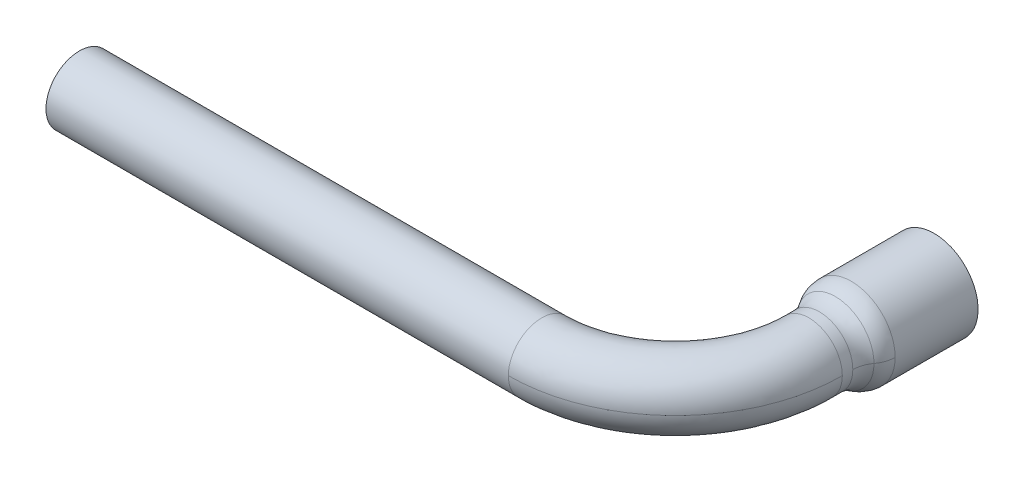
ISO-10303-21;
HEADER;
FILE_DESCRIPTION(('STEP AP214'),'2;1');
FILE_NAME('part.step','',(''),(''),'','','');
FILE_SCHEMA(('AUTOMOTIVE_DESIGN { 1 0 10303 214 1 1 1 1 }'));
ENDSEC;
DATA;
#1=APPLICATION_CONTEXT('core data for automotive mechanical design processes');
#2=APPLICATION_PROTOCOL_DEFINITION('international standard','automotive_design',2000,#1);
#3=PRODUCT_CONTEXT('',#1,'mechanical');
#4=PRODUCT('Part','Part','',(#3));
#5=PRODUCT_RELATED_PRODUCT_CATEGORY('part','',(#4));
#6=PRODUCT_DEFINITION_FORMATION('','',#4);
#7=PRODUCT_DEFINITION_CONTEXT('part definition',#1,'design');
#8=PRODUCT_DEFINITION('design','',#6,#7);
#9=PRODUCT_DEFINITION_SHAPE('','',#8);
#10=(LENGTH_UNIT() NAMED_UNIT(*) SI_UNIT(.MILLI.,.METRE.));
#11=(NAMED_UNIT(*) PLANE_ANGLE_UNIT() SI_UNIT($,.RADIAN.));
#12=(NAMED_UNIT(*) SI_UNIT($,.STERADIAN.) SOLID_ANGLE_UNIT());
#13=UNCERTAINTY_MEASURE_WITH_UNIT(LENGTH_MEASURE(1.E-05),#10,'distance_accuracy_value','');
#14=(GEOMETRIC_REPRESENTATION_CONTEXT(3) GLOBAL_UNCERTAINTY_ASSIGNED_CONTEXT((#13)) GLOBAL_UNIT_ASSIGNED_CONTEXT((#10,
#11,#12)) REPRESENTATION_CONTEXT('',''));
#15=CARTESIAN_POINT('',(0.,0.,0.));
#16=DIRECTION('',(0.,0.,1.));
#17=DIRECTION('',(1.,0.,0.));
#18=AXIS2_PLACEMENT_3D('',#15,#16,#17);
#19=CARTESIAN_POINT('',(-3.2131,-3.2131,0.));
#20=DIRECTION('',(0.,0.,1.));
#21=DIRECTION('',(1.,0.,0.));
#22=AXIS2_PLACEMENT_3D('',#19,#20,#21);
#23=PLANE('',#22);
#24=CARTESIAN_POINT('',(0.,0.,0.));
#25=DIRECTION('',(0.,0.,1.));
#26=DIRECTION('',(1.,0.,0.));
#27=AXIS2_PLACEMENT_3D('',#24,#25,#26);
#28=CIRCLE('',#27,3.175);
#29=CARTESIAN_POINT('',(3.175,0.,0.));
#30=VERTEX_POINT('',#29);
#31=EDGE_CURVE('E21',#30,#30,#28,.T.);
#32=ORIENTED_EDGE('',*,*,#31,.F.);
#33=EDGE_LOOP('',(#32));
#34=FACE_BOUND('',#33,.T.);
#35=ADVANCED_FACE('F17',(#34),#23,.F.);
#36=CARTESIAN_POINT('',(0.,0.,-7.62));
#37=DIRECTION('',(0.,0.,1.));
#38=DIRECTION('',(1.,0.,0.));
#39=AXIS2_PLACEMENT_3D('',#36,#37,#38);
#40=CYLINDRICAL_SURFACE('',#39,3.175);
#41=CARTESIAN_POINT('',(0.,0.,-7.62));
#42=DIRECTION('',(0.,0.,1.));
#43=DIRECTION('',(1.,0.,0.));
#44=AXIS2_PLACEMENT_3D('',#41,#42,#43);
#45=CIRCLE('',#44,3.175);
#46=CARTESIAN_POINT('',(3.175,0.,-7.62));
#47=VERTEX_POINT('',#46);
#48=EDGE_CURVE('E121',#47,#47,#45,.T.);
#49=ORIENTED_EDGE('',*,*,#48,.F.);
#50=EDGE_LOOP('',(#49));
#51=FACE_BOUND('',#50,.T.);
#52=ORIENTED_EDGE('',*,*,#31,.T.);
#53=EDGE_LOOP('',(#52));
#54=FACE_BOUND('',#53,.T.);
#55=ADVANCED_FACE('F128',(#51,#54),#40,.F.);
#56=CARTESIAN_POINT('',(4.2251,-4.2251,-7.62));
#57=DIRECTION('',(0.,0.,-1.));
#58=DIRECTION('',(-1.,0.,0.));
#59=AXIS2_PLACEMENT_3D('',#56,#57,#58);
#60=PLANE('',#59);
#61=ORIENTED_EDGE('',*,*,#48,.T.);
#62=EDGE_LOOP('',(#61));
#63=FACE_BOUND('',#62,.T.);
#64=CARTESIAN_POINT('',(0.,0.,-7.62));
#65=DIRECTION('',(0.,0.,-1.));
#66=DIRECTION('',(-1.,0.,0.));
#67=AXIS2_PLACEMENT_3D('',#64,#65,#66);
#68=CIRCLE('',#67,4.175);
#69=CARTESIAN_POINT('',(-4.175,0.,-7.62));
#70=VERTEX_POINT('',#69);
#71=EDGE_CURVE('E81',#70,#70,#68,.T.);
#72=ORIENTED_EDGE('',*,*,#71,.T.);
#73=EDGE_LOOP('',(#72));
#74=FACE_BOUND('',#73,.T.);
#75=ADVANCED_FACE('F136',(#63,#74),#60,.T.);
#76=CARTESIAN_POINT('',(0.,0.,0.263351798));
#77=DIRECTION('',(0.,0.,-1.));
#78=DIRECTION('',(-1.,0.,0.));
#79=AXIS2_PLACEMENT_3D('',#76,#77,#78);
#80=CYLINDRICAL_SURFACE('',#79,4.175);
#81=CARTESIAN_POINT('',(0.,0.,0.263351798));
#82=DIRECTION('',(0.,0.,1.));
#83=DIRECTION('',(1.,0.,0.));
#84=AXIS2_PLACEMENT_3D('',#81,#82,#83);
#85=CIRCLE('',#84,4.175);
#86=CARTESIAN_POINT('',(-4.175,-1.8744419934498E-10,0.263351798));
#87=VERTEX_POINT('',#86);
#88=CARTESIAN_POINT('',(4.175,-6.42230110538631E-10,0.263351798));
#89=VERTEX_POINT('',#88);
#90=EDGE_CURVE('E83',#87,#89,#85,.T.);
#91=ORIENTED_EDGE('',*,*,#90,.F.);
#92=CARTESIAN_POINT('',(0.,0.,0.263351798));
#93=DIRECTION('',(0.,0.,1.));
#94=DIRECTION('',(1.,0.,0.));
#95=AXIS2_PLACEMENT_3D('',#92,#93,#94);
#96=CIRCLE('',#95,4.175);
#97=EDGE_CURVE('E72',#89,#87,#96,.T.);
#98=ORIENTED_EDGE('',*,*,#97,.F.);
#99=EDGE_LOOP('',(#91,#98));
#100=FACE_BOUND('',#99,.T.);
#101=ORIENTED_EDGE('',*,*,#71,.F.);
#102=EDGE_LOOP('',(#101));
#103=FACE_BOUND('',#102,.T.);
#104=ADVANCED_FACE('F84',(#100,#103),#80,.T.);
#105=CARTESIAN_POINT('',(-4.175,0.,0.263351798));
#106=CARTESIAN_POINT('',(-4.175,8.35,0.263351798));
#107=CARTESIAN_POINT('',(4.175,8.35,0.263351798));
#108=CARTESIAN_POINT('',(4.175,0.,0.263351798));
#109=CARTESIAN_POINT('',(-4.175,0.,0.813101204));
#110=CARTESIAN_POINT('',(-4.175,8.35,0.813101204));
#111=CARTESIAN_POINT('',(4.175,8.35,0.813101204));
#112=CARTESIAN_POINT('',(4.175,0.,0.813101204));
#113=CARTESIAN_POINT('',(-4.002528272,0.,1.335095373));
#114=CARTESIAN_POINT('',(-4.002528272,8.005056544,1.335095373));
#115=CARTESIAN_POINT('',(4.002528272,8.005056544,1.335095373));
#116=CARTESIAN_POINT('',(4.002528272,0.,1.335095373));
#117=CARTESIAN_POINT('',(-3.675,0.,1.776626393));
#118=CARTESIAN_POINT('',(-3.675,7.35,1.776626393));
#119=CARTESIAN_POINT('',(3.675,7.35,1.776626393));
#120=CARTESIAN_POINT('',(3.675,0.,1.776626393));
#121=(BOUNDED_SURFACE() B_SPLINE_SURFACE(3,3,((#105,#106,#107,#108),(#109,#110,#111,#112),(#113,
#114,#115,#116),(#117,#118,#119,#120)),.UNSPECIFIED.,.F.,.F.,
.F.) B_SPLINE_SURFACE_WITH_KNOTS((4,4),(4,4),(0.,1.),(0.,1.),
.UNSPECIFIED.) GEOMETRIC_REPRESENTATION_ITEM() RATIONAL_B_SPLINE_SURFACE(((1.,0.333333333333333,
0.333333333333333,1.),(0.966341952951531,0.322113984317177,0.322113984317177,0.966341952951531),
(0.966341952951531,0.322113984317177,0.322113984317177,0.966341952951531),(1.,0.333333333333333,
0.333333333333333,1.))) REPRESENTATION_ITEM('') SURFACE());
#122=CARTESIAN_POINT('',(-4.175,0.,0.263351798));
#123=CARTESIAN_POINT('',(-4.175,0.,0.813101204));
#124=CARTESIAN_POINT('',(-4.002528272,0.,1.335095373));
#125=CARTESIAN_POINT('',(-3.675,0.,1.776626393));
#126=(BOUNDED_CURVE() B_SPLINE_CURVE(3,(#122,#123,#124,#125),.UNSPECIFIED.,.F.,
.F.) B_SPLINE_CURVE_WITH_KNOTS((4,4),(0.,1.),
.UNSPECIFIED.) CURVE() GEOMETRIC_REPRESENTATION_ITEM() RATIONAL_B_SPLINE_CURVE((1.,
0.966341952951531,0.966341952951531,1.)) REPRESENTATION_ITEM(''));
#127=CARTESIAN_POINT('',(-3.67500000002567,0.,1.7766263924728));
#128=VERTEX_POINT('',#127);
#129=EDGE_CURVE('E77',#128,#87,#126,.F.);
#130=CARTESIAN_POINT('',(0.,0.,1.77662639229558));
#131=DIRECTION('',(0.,0.,-1.));
#132=DIRECTION('',(0.,1.,0.));
#133=AXIS2_PLACEMENT_3D('',#130,#131,#132);
#134=CIRCLE('',#133,3.67500000003533);
#135=CARTESIAN_POINT('',(3.67500000002567,0.,1.7766263924728));
#136=VERTEX_POINT('',#135);
#137=EDGE_CURVE('E87',#128,#136,#134,.T.);
#138=CARTESIAN_POINT('',(4.175,0.,0.263351798));
#139=CARTESIAN_POINT('',(4.175,0.,0.813101204));
#140=CARTESIAN_POINT('',(4.002528272,0.,1.335095373));
#141=CARTESIAN_POINT('',(3.675,0.,1.776626393));
#142=(BOUNDED_CURVE() B_SPLINE_CURVE(3,(#138,#139,#140,#141),.UNSPECIFIED.,.F.,
.F.) B_SPLINE_CURVE_WITH_KNOTS((4,4),(0.,1.),
.UNSPECIFIED.) CURVE() GEOMETRIC_REPRESENTATION_ITEM() RATIONAL_B_SPLINE_CURVE((1.,
0.966341952951531,0.966341952951531,1.)) REPRESENTATION_ITEM(''));
#143=EDGE_CURVE('E79',#89,#136,#142,.T.);
#144=ORIENTED_EDGE('',*,*,#97,.T.);
#145=ORIENTED_EDGE('',*,*,#129,.F.);
#146=ORIENTED_EDGE('',*,*,#137,.T.);
#147=ORIENTED_EDGE('',*,*,#143,.F.);
#148=EDGE_LOOP('',(#144,#145,#146,#147));
#149=FACE_BOUND('',#148,.T.);
#150=ADVANCED_FACE('F75',(#149),#121,.T.);
#151=CARTESIAN_POINT('',(4.175,0.,0.263351798));
#152=CARTESIAN_POINT('',(4.175,-8.35,0.263351798));
#153=CARTESIAN_POINT('',(-4.175,-8.35,0.263351798));
#154=CARTESIAN_POINT('',(-4.175,0.,0.263351798));
#155=CARTESIAN_POINT('',(4.175,0.,0.813101204));
#156=CARTESIAN_POINT('',(4.175,-8.35,0.813101204));
#157=CARTESIAN_POINT('',(-4.175,-8.35,0.813101204));
#158=CARTESIAN_POINT('',(-4.175,0.,0.813101204));
#159=CARTESIAN_POINT('',(4.002528272,0.,1.335095373));
#160=CARTESIAN_POINT('',(4.002528272,-8.005056544,1.335095373));
#161=CARTESIAN_POINT('',(-4.002528272,-8.005056544,1.335095373));
#162=CARTESIAN_POINT('',(-4.002528272,0.,1.335095373));
#163=CARTESIAN_POINT('',(3.675,0.,1.776626393));
#164=CARTESIAN_POINT('',(3.675,-7.35,1.776626393));
#165=CARTESIAN_POINT('',(-3.675,-7.35,1.776626393));
#166=CARTESIAN_POINT('',(-3.675,0.,1.776626393));
#167=(BOUNDED_SURFACE() B_SPLINE_SURFACE(3,3,((#151,#152,#153,#154),(#155,#156,#157,#158),(#159,
#160,#161,#162),(#163,#164,#165,#166)),.UNSPECIFIED.,.F.,.F.,
.F.) B_SPLINE_SURFACE_WITH_KNOTS((4,4),(4,4),(0.,1.),(0.,1.),
.UNSPECIFIED.) GEOMETRIC_REPRESENTATION_ITEM() RATIONAL_B_SPLINE_SURFACE(((1.,0.333333333333333,
0.333333333333333,1.),(0.966341952951531,0.322113984317177,0.322113984317177,0.966341952951531),
(0.966341952951531,0.322113984317177,0.322113984317177,0.966341952951531),(1.,0.333333333333333,
0.333333333333333,1.))) REPRESENTATION_ITEM('') SURFACE());
#168=CARTESIAN_POINT('',(0.,0.,1.77662639229558));
#169=DIRECTION('',(0.,0.,-1.));
#170=DIRECTION('',(0.,1.,0.));
#171=AXIS2_PLACEMENT_3D('',#168,#169,#170);
#172=CIRCLE('',#171,3.67500000003533);
#173=EDGE_CURVE('E92',#136,#128,#172,.T.);
#174=ORIENTED_EDGE('',*,*,#129,.T.);
#175=ORIENTED_EDGE('',*,*,#90,.T.);
#176=ORIENTED_EDGE('',*,*,#143,.T.);
#177=ORIENTED_EDGE('',*,*,#173,.T.);
#178=EDGE_LOOP('',(#174,#175,#176,#177));
#179=FACE_BOUND('',#178,.T.);
#180=ADVANCED_FACE('F90',(#179),#167,.T.);
#181=CARTESIAN_POINT('',(-3.18768942,0.,3.543477866));
#182=CARTESIAN_POINT('',(-3.18768942,6.37537884,3.543477866));
#183=CARTESIAN_POINT('',(3.18768942,6.37537884,3.543477866));
#184=CARTESIAN_POINT('',(3.18768942,0.,3.543477866));
#185=CARTESIAN_POINT('',(-3.114680729,0.,2.815826202));
#186=CARTESIAN_POINT('',(-3.114680729,6.229361458,2.815826202));
#187=CARTESIAN_POINT('',(3.114680729,6.229361458,2.815826202));
#188=CARTESIAN_POINT('',(3.114680729,0.,2.815826202));
#189=CARTESIAN_POINT('',(-3.344111558,0.,2.121442512));
#190=CARTESIAN_POINT('',(-3.344111558,6.688223116,2.121442512));
#191=CARTESIAN_POINT('',(3.344111558,6.688223116,2.121442512));
#192=CARTESIAN_POINT('',(3.344111558,0.,2.121442512));
#193=CARTESIAN_POINT('',(-3.836266876,0.,1.580526292));
#194=CARTESIAN_POINT('',(-3.836266876,7.672533752,1.580526292));
#195=CARTESIAN_POINT('',(3.836266876,7.672533752,1.580526292));
#196=CARTESIAN_POINT('',(3.836266876,0.,1.580526292));
#197=(BOUNDED_SURFACE() B_SPLINE_SURFACE(3,3,((#181,#182,#183,#184),(#185,#186,#187,#188),(#189,
#190,#191,#192),(#193,#194,#195,#196)),.UNSPECIFIED.,.F.,.F.,
.F.) B_SPLINE_SURFACE_WITH_KNOTS((4,4),(4,4),(0.,1.),(0.,1.),
.UNSPECIFIED.) GEOMETRIC_REPRESENTATION_ITEM() RATIONAL_B_SPLINE_SURFACE(((1.,0.333333333333333,
0.333333333333333,1.),(0.94229919423639,0.31409973141213,0.31409973141213,0.94229919423639),
(0.94229919423639,0.31409973141213,0.31409973141213,0.94229919423639),(1.,0.333333333333333,
0.333333333333333,1.))) REPRESENTATION_ITEM('') SURFACE());
#198=CARTESIAN_POINT('',(-3.18768942,0.,3.543477866));
#199=CARTESIAN_POINT('',(-3.114680729,0.,2.815826202));
#200=CARTESIAN_POINT('',(-3.344111558,0.,2.121442512));
#201=CARTESIAN_POINT('',(-3.836266876,0.,1.580526292));
#202=(BOUNDED_CURVE() B_SPLINE_CURVE(3,(#198,#199,#200,#201),.UNSPECIFIED.,.F.,
.F.) B_SPLINE_CURVE_WITH_KNOTS((4,4),(0.,1.),
.UNSPECIFIED.) CURVE() GEOMETRIC_REPRESENTATION_ITEM() RATIONAL_B_SPLINE_CURVE((1.,
0.94229919423639,0.94229919423639,1.)) REPRESENTATION_ITEM(''));
#203=CARTESIAN_POINT('',(-3.17499999996243,-2.85094770261227E-10,3.28990098796332));
#204=VERTEX_POINT('',#203);
#205=EDGE_CURVE('E58',#128,#204,#202,.F.);
#206=CARTESIAN_POINT('',(0.,0.,3.289900988));
#207=DIRECTION('',(0.,0.,-1.));
#208=DIRECTION('',(-1.,0.,0.));
#209=AXIS2_PLACEMENT_3D('',#206,#207,#208);
#210=CIRCLE('',#209,3.175);
#211=CARTESIAN_POINT('',(3.17499999996243,-9.76805078304265E-10,3.28990098796332));
#212=VERTEX_POINT('',#211);
#213=EDGE_CURVE('E316',#204,#212,#210,.T.);
#214=CARTESIAN_POINT('',(3.18768942,0.,3.543477866));
#215=CARTESIAN_POINT('',(3.114680729,0.,2.815826202));
#216=CARTESIAN_POINT('',(3.344111558,0.,2.121442512));
#217=CARTESIAN_POINT('',(3.836266876,0.,1.580526292));
#218=(BOUNDED_CURVE() B_SPLINE_CURVE(3,(#214,#215,#216,#217),.UNSPECIFIED.,.F.,
.F.) B_SPLINE_CURVE_WITH_KNOTS((4,4),(0.,1.),
.UNSPECIFIED.) CURVE() GEOMETRIC_REPRESENTATION_ITEM() RATIONAL_B_SPLINE_CURVE((1.,
0.94229919423639,0.94229919423639,1.)) REPRESENTATION_ITEM(''));
#219=EDGE_CURVE('E300',#212,#136,#218,.T.);
#220=ORIENTED_EDGE('',*,*,#137,.F.);
#221=ORIENTED_EDGE('',*,*,#205,.T.);
#222=ORIENTED_EDGE('',*,*,#213,.T.);
#223=ORIENTED_EDGE('',*,*,#219,.T.);
#224=EDGE_LOOP('',(#220,#221,#222,#223));
#225=FACE_BOUND('',#224,.T.);
#226=ADVANCED_FACE('F175',(#225),#197,.F.);
#227=CARTESIAN_POINT('',(3.18768942,0.,3.543477866));
#228=CARTESIAN_POINT('',(3.18768942,-6.37537884,3.543477866));
#229=CARTESIAN_POINT('',(-3.18768942,-6.37537884,3.543477866));
#230=CARTESIAN_POINT('',(-3.18768942,0.,3.543477866));
#231=CARTESIAN_POINT('',(3.114680729,0.,2.815826202));
#232=CARTESIAN_POINT('',(3.114680729,-6.229361458,2.815826202));
#233=CARTESIAN_POINT('',(-3.114680729,-6.229361458,2.815826202));
#234=CARTESIAN_POINT('',(-3.114680729,0.,2.815826202));
#235=CARTESIAN_POINT('',(3.344111558,0.,2.121442512));
#236=CARTESIAN_POINT('',(3.344111558,-6.688223116,2.121442512));
#237=CARTESIAN_POINT('',(-3.344111558,-6.688223116,2.121442512));
#238=CARTESIAN_POINT('',(-3.344111558,0.,2.121442512));
#239=CARTESIAN_POINT('',(3.836266876,0.,1.580526292));
#240=CARTESIAN_POINT('',(3.836266876,-7.672533752,1.580526292));
#241=CARTESIAN_POINT('',(-3.836266876,-7.672533752,1.580526292));
#242=CARTESIAN_POINT('',(-3.836266876,0.,1.580526292));
#243=(BOUNDED_SURFACE() B_SPLINE_SURFACE(3,3,((#227,#228,#229,#230),(#231,#232,#233,#234),(#235,
#236,#237,#238),(#239,#240,#241,#242)),.UNSPECIFIED.,.F.,.F.,
.F.) B_SPLINE_SURFACE_WITH_KNOTS((4,4),(4,4),(0.,1.),(0.,1.),
.UNSPECIFIED.) GEOMETRIC_REPRESENTATION_ITEM() RATIONAL_B_SPLINE_SURFACE(((1.,0.333333333333333,
0.333333333333333,1.),(0.94229919423639,0.31409973141213,0.31409973141213,0.94229919423639),
(0.94229919423639,0.31409973141213,0.31409973141213,0.94229919423639),(1.,0.333333333333333,
0.333333333333333,1.))) REPRESENTATION_ITEM('') SURFACE());
#244=CARTESIAN_POINT('',(0.,0.,3.289900988));
#245=DIRECTION('',(0.,0.,-1.));
#246=DIRECTION('',(-1.,0.,0.));
#247=AXIS2_PLACEMENT_3D('',#244,#245,#246);
#248=CIRCLE('',#247,3.175);
#249=EDGE_CURVE('E119',#212,#204,#248,.T.);
#250=ORIENTED_EDGE('',*,*,#219,.F.);
#251=ORIENTED_EDGE('',*,*,#249,.T.);
#252=ORIENTED_EDGE('',*,*,#205,.F.);
#253=ORIENTED_EDGE('',*,*,#173,.F.);
#254=EDGE_LOOP('',(#250,#251,#252,#253));
#255=FACE_BOUND('',#254,.T.);
#256=ADVANCED_FACE('F170',(#255),#243,.F.);
#257=CARTESIAN_POINT('',(-56.650003277,-3.2131,13.77383992));
#258=DIRECTION('',(-1.,0.,0.));
#259=DIRECTION('',(0.,0.,1.));
#260=AXIS2_PLACEMENT_3D('',#257,#258,#259);
#261=PLANE('',#260);
#262=CARTESIAN_POINT('',(-56.650003277,0.,16.98693992));
#263=DIRECTION('',(-1.,0.,0.));
#264=DIRECTION('',(0.,0.,1.));
#265=AXIS2_PLACEMENT_3D('',#262,#263,#264);
#266=CIRCLE('',#265,3.175);
#267=CARTESIAN_POINT('',(-56.650003277,0.,20.16193992));
#268=VERTEX_POINT('',#267);
#269=EDGE_CURVE('E116',#268,#268,#266,.T.);
#270=ORIENTED_EDGE('',*,*,#269,.T.);
#271=EDGE_LOOP('',(#270));
#272=FACE_BOUND('',#271,.T.);
#273=ADVANCED_FACE('F19',(#272),#261,.T.);
#274=CARTESIAN_POINT('',(0.,0.,4.28693992));
#275=DIRECTION('',(0.,0.,-1.));
#276=DIRECTION('',(-1.,0.,0.));
#277=AXIS2_PLACEMENT_3D('',#274,#275,#276);
#278=CYLINDRICAL_SURFACE('',#277,3.175);
#279=CARTESIAN_POINT('',(0.,0.,4.28693992));
#280=DIRECTION('',(0.,0.,-1.));
#281=DIRECTION('',(-1.,0.,0.));
#282=AXIS2_PLACEMENT_3D('',#279,#280,#281);
#283=CIRCLE('',#282,3.175);
#284=CARTESIAN_POINT('',(-3.175,-1.75654311156656E-09,4.28693992));
#285=VERTEX_POINT('',#284);
#286=CARTESIAN_POINT('',(3.17499999988794,-2.40774522707821E-09,4.28693992));
#287=VERTEX_POINT('',#286);
#288=EDGE_CURVE('E50',#285,#287,#283,.F.);
#289=ORIENTED_EDGE('',*,*,#288,.F.);
#290=CARTESIAN_POINT('',(0.,0.,4.28693992));
#291=DIRECTION('',(0.,0.,-1.));
#292=DIRECTION('',(-1.,0.,0.));
#293=AXIS2_PLACEMENT_3D('',#290,#291,#292);
#294=CIRCLE('',#293,3.175);
#295=EDGE_CURVE('E46',#287,#285,#294,.F.);
#296=ORIENTED_EDGE('',*,*,#295,.F.);
#297=EDGE_LOOP('',(#289,#296));
#298=FACE_BOUND('',#297,.T.);
#299=ORIENTED_EDGE('',*,*,#213,.F.);
#300=ORIENTED_EDGE('',*,*,#249,.F.);
#301=EDGE_LOOP('',(#299,#300));
#302=FACE_BOUND('',#301,.T.);
#303=ADVANCED_FACE('F167',(#298,#302),#278,.T.);
#304=CARTESIAN_POINT('',(-12.7,0.,16.98693992));
#305=DIRECTION('',(-1.,0.,0.));
#306=DIRECTION('',(0.,0.,1.));
#307=AXIS2_PLACEMENT_3D('',#304,#305,#306);
#308=CYLINDRICAL_SURFACE('',#307,3.175);
#309=CARTESIAN_POINT('',(-12.7,0.,16.98693992));
#310=DIRECTION('',(-1.,0.,0.));
#311=DIRECTION('',(0.,0.,1.));
#312=AXIS2_PLACEMENT_3D('',#309,#310,#311);
#313=CIRCLE('',#312,3.175);
#314=CARTESIAN_POINT('',(-12.7,-1.75654254653366E-09,20.16193992));
#315=VERTEX_POINT('',#314);
#316=CARTESIAN_POINT('',(-12.7,-2.40774579211112E-09,13.8119399198998));
#317=VERTEX_POINT('',#316);
#318=EDGE_CURVE('E27',#315,#317,#313,.F.);
#319=ORIENTED_EDGE('',*,*,#318,.F.);
#320=CARTESIAN_POINT('',(-12.7,0.,16.98693992));
#321=DIRECTION('',(-1.,0.,0.));
#322=DIRECTION('',(0.,0.,1.));
#323=AXIS2_PLACEMENT_3D('',#320,#321,#322);
#324=CIRCLE('',#323,3.175);
#325=EDGE_CURVE('E35',#317,#315,#324,.F.);
#326=ORIENTED_EDGE('',*,*,#325,.F.);
#327=EDGE_LOOP('',(#319,#326));
#328=FACE_BOUND('',#327,.T.);
#329=ORIENTED_EDGE('',*,*,#269,.F.);
#330=EDGE_LOOP('',(#329));
#331=FACE_BOUND('',#330,.T.);
#332=ADVANCED_FACE('F147',(#328,#331),#308,.T.);
#333=CARTESIAN_POINT('',(3.159138225,-0.316971098,4.28693992));
#334=CARTESIAN_POINT('',(3.159138225,-0.316971098,13.577008004));
#335=CARTESIAN_POINT('',(-3.409931915,-0.316971098,20.146078144));
#336=CARTESIAN_POINT('',(-12.7,-0.316971098,20.146078144));
#337=CARTESIAN_POINT('',(3.359887884,1.683829374,4.28693992));
#338=CARTESIAN_POINT('',(3.359887884,1.683829374,13.694604432));
#339=CARTESIAN_POINT('',(-3.292335488,1.683829374,20.346827804));
#340=CARTESIAN_POINT('',(-12.7,1.683829374,20.346827804));
#341=CARTESIAN_POINT('',(2.010846328,3.175,4.28693992));
#342=CARTESIAN_POINT('',(2.010846328,3.175,12.904354185));
#343=CARTESIAN_POINT('',(-4.082585735,3.175,18.997786248));
#344=CARTESIAN_POINT('',(-12.7,3.175,18.997786248));
#345=CARTESIAN_POINT('',(0.,3.175,4.28693992));
#346=CARTESIAN_POINT('',(0.,3.175,11.726427677));
#347=CARTESIAN_POINT('',(-5.260512242,3.175,16.98693992));
#348=CARTESIAN_POINT('',(-12.7,3.175,16.98693992));
#349=CARTESIAN_POINT('',(-2.010846328,3.175,4.28693992));
#350=CARTESIAN_POINT('',(-2.010846328,3.175,10.54850117));
#351=CARTESIAN_POINT('',(-6.438438749,3.175,14.976093592));
#352=CARTESIAN_POINT('',(-12.7,3.175,14.976093592));
#353=CARTESIAN_POINT('',(-3.359887884,1.683829374,4.28693992));
#354=CARTESIAN_POINT('',(-3.359887884,1.683829374,9.758250923));
#355=CARTESIAN_POINT('',(-7.228688997,1.683829374,13.627052036));
#356=CARTESIAN_POINT('',(-12.7,1.683829374,13.627052036));
#357=CARTESIAN_POINT('',(-3.159138225,-0.316971098,4.28693992));
#358=CARTESIAN_POINT('',(-3.159138225,-0.316971098,9.875847351));
#359=CARTESIAN_POINT('',(-7.111092569,-0.316971098,13.827801695));
#360=CARTESIAN_POINT('',(-12.7,-0.316971098,13.827801695));
#361=(BOUNDED_SURFACE() B_SPLINE_SURFACE(3,3,((#333,#334,#335,#336),(#337,#338,#339,#340),(#341,
#342,#343,#344),(#345,#346,#347,#348),(#349,#350,#351,#352),(#353,#354,#355,#356),(#357,#358,
#359,#360)),.UNSPECIFIED.,.F.,.F.,.F.) B_SPLINE_SURFACE_WITH_KNOTS((4,3,4),(4,4),(0.,0.5,1.),
(0.,1.),.UNSPECIFIED.) GEOMETRIC_REPRESENTATION_ITEM() RATIONAL_B_SPLINE_SURFACE(((1.,
0.804737854124365,0.804737854124365,1.),(0.780588314885162,0.62816896547524,0.62816896547524,
0.780588314885162),(0.780588314885162,0.62816896547524,0.62816896547524,0.780588314885162),(1.,
0.804737854124365,0.804737854124365,1.),(0.780588314885162,0.62816896547524,0.62816896547524,
0.780588314885162),(0.780588314885162,0.62816896547524,0.62816896547524,0.780588314885162),(1.,
0.804737854124365,0.804737854124365,1.))) REPRESENTATION_ITEM('') SURFACE());
#362=CARTESIAN_POINT('',(-12.7,-3.51308583250411E-09,4.28693992));
#363=DIRECTION('',(0.,1.,0.));
#364=DIRECTION('',(0.,0.,1.));
#365=AXIS2_PLACEMENT_3D('',#362,#363,#364);
#366=CIRCLE('',#365,9.52499999979951);
#367=EDGE_CURVE('E11',#317,#285,#366,.T.);
#368=CARTESIAN_POINT('',(-12.7,-3.51308469108058E-09,4.28693992));
#369=DIRECTION('',(0.,-1.,0.));
#370=DIRECTION('',(0.,0.,-1.));
#371=AXIS2_PLACEMENT_3D('',#368,#369,#370);
#372=CIRCLE('',#371,15.8749999997759);
#373=EDGE_CURVE('E112',#287,#315,#372,.T.);
#374=ORIENTED_EDGE('',*,*,#367,.F.);
#375=ORIENTED_EDGE('',*,*,#325,.T.);
#376=ORIENTED_EDGE('',*,*,#373,.F.);
#377=ORIENTED_EDGE('',*,*,#295,.T.);
#378=EDGE_LOOP('',(#374,#375,#376,#377));
#379=FACE_BOUND('',#378,.T.);
#380=ADVANCED_FACE('F141',(#379),#361,.T.);
#381=CARTESIAN_POINT('',(-3.159138225,0.316971098,4.28693992));
#382=CARTESIAN_POINT('',(-3.159138225,0.316971098,9.875847351));
#383=CARTESIAN_POINT('',(-7.111092569,0.316971098,13.827801695));
#384=CARTESIAN_POINT('',(-12.7,0.316971098,13.827801695));
#385=CARTESIAN_POINT('',(-3.359887884,-1.683829374,4.28693992));
#386=CARTESIAN_POINT('',(-3.359887884,-1.683829374,9.758250923));
#387=CARTESIAN_POINT('',(-7.228688997,-1.683829374,13.627052036));
#388=CARTESIAN_POINT('',(-12.7,-1.683829374,13.627052036));
#389=CARTESIAN_POINT('',(-2.010846328,-3.175,4.28693992));
#390=CARTESIAN_POINT('',(-2.010846328,-3.175,10.54850117));
#391=CARTESIAN_POINT('',(-6.438438749,-3.175,14.976093592));
#392=CARTESIAN_POINT('',(-12.7,-3.175,14.976093592));
#393=CARTESIAN_POINT('',(0.,-3.175,4.28693992));
#394=CARTESIAN_POINT('',(0.,-3.175,11.726427677));
#395=CARTESIAN_POINT('',(-5.260512242,-3.175,16.98693992));
#396=CARTESIAN_POINT('',(-12.7,-3.175,16.98693992));
#397=CARTESIAN_POINT('',(2.010846328,-3.175,4.28693992));
#398=CARTESIAN_POINT('',(2.010846328,-3.175,12.904354185));
#399=CARTESIAN_POINT('',(-4.082585735,-3.175,18.997786248));
#400=CARTESIAN_POINT('',(-12.7,-3.175,18.997786248));
#401=CARTESIAN_POINT('',(3.359887884,-1.683829374,4.28693992));
#402=CARTESIAN_POINT('',(3.359887884,-1.683829374,13.694604432));
#403=CARTESIAN_POINT('',(-3.292335488,-1.683829374,20.346827804));
#404=CARTESIAN_POINT('',(-12.7,-1.683829374,20.346827804));
#405=CARTESIAN_POINT('',(3.159138225,0.316971098,4.28693992));
#406=CARTESIAN_POINT('',(3.159138225,0.316971098,13.577008004));
#407=CARTESIAN_POINT('',(-3.409931915,0.316971098,20.146078144));
#408=CARTESIAN_POINT('',(-12.7,0.316971098,20.146078144));
#409=(BOUNDED_SURFACE() B_SPLINE_SURFACE(3,3,((#381,#382,#383,#384),(#385,#386,#387,#388),(#389,
#390,#391,#392),(#393,#394,#395,#396),(#397,#398,#399,#400),(#401,#402,#403,#404),(#405,#406,
#407,#408)),.UNSPECIFIED.,.F.,.F.,.F.) B_SPLINE_SURFACE_WITH_KNOTS((4,3,4),(4,4),(0.,0.5,1.),
(0.,1.),.UNSPECIFIED.) GEOMETRIC_REPRESENTATION_ITEM() RATIONAL_B_SPLINE_SURFACE(((1.,
0.804737854124365,0.804737854124365,1.),(0.780588314885162,0.62816896547524,0.62816896547524,
0.780588314885162),(0.780588314885162,0.62816896547524,0.62816896547524,0.780588314885162),(1.,
0.804737854124365,0.804737854124365,1.),(0.780588314885162,0.62816896547524,0.62816896547524,
0.780588314885162),(0.780588314885162,0.62816896547524,0.62816896547524,0.780588314885162),(1.,
0.804737854124365,0.804737854124365,1.))) REPRESENTATION_ITEM('') SURFACE());
#410=ORIENTED_EDGE('',*,*,#318,.T.);
#411=ORIENTED_EDGE('',*,*,#367,.T.);
#412=ORIENTED_EDGE('',*,*,#288,.T.);
#413=ORIENTED_EDGE('',*,*,#373,.T.);
#414=EDGE_LOOP('',(#410,#411,#412,#413));
#415=FACE_BOUND('',#414,.T.);
#416=ADVANCED_FACE('F139',(#415),#409,.T.);
#417=CLOSED_SHELL('',(#35,#55,#75,#104,#150,#180,#226,#256,#273,#303,#332,#380,#416));
#418=MANIFOLD_SOLID_BREP('B1',#417);
#419=ADVANCED_BREP_SHAPE_REPRESENTATION('',(#18,#418),#14);
#420=SHAPE_DEFINITION_REPRESENTATION(#9,#419);
ENDSEC;
END-ISO-10303-21;
